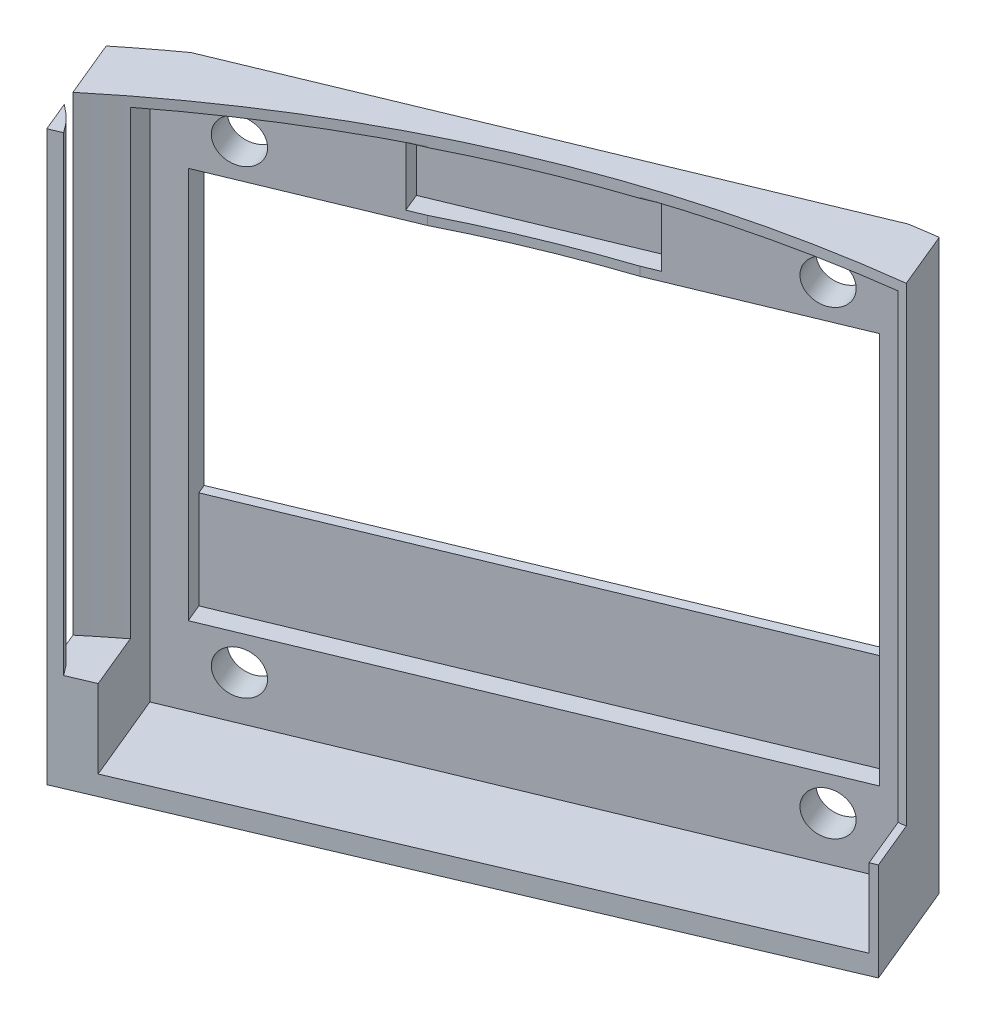
ISO-10303-21;
HEADER;
FILE_DESCRIPTION(('STEP AP214'),'2;1');
FILE_NAME('part.step','',(''),(''),'','','');
FILE_SCHEMA(('AUTOMOTIVE_DESIGN { 1 0 10303 214 1 1 1 1 }'));
ENDSEC;
DATA;
#1=APPLICATION_CONTEXT('core data for automotive mechanical design processes');
#2=APPLICATION_PROTOCOL_DEFINITION('international standard','automotive_design',2000,#1);
#3=PRODUCT_CONTEXT('',#1,'mechanical');
#4=PRODUCT('Part','Part','',(#3));
#5=PRODUCT_RELATED_PRODUCT_CATEGORY('part','',(#4));
#6=PRODUCT_DEFINITION_FORMATION('','',#4);
#7=PRODUCT_DEFINITION_CONTEXT('part definition',#1,'design');
#8=PRODUCT_DEFINITION('design','',#6,#7);
#9=PRODUCT_DEFINITION_SHAPE('','',#8);
#10=(LENGTH_UNIT() NAMED_UNIT(*) SI_UNIT(.MILLI.,.METRE.));
#11=(NAMED_UNIT(*) PLANE_ANGLE_UNIT() SI_UNIT($,.RADIAN.));
#12=(NAMED_UNIT(*) SI_UNIT($,.STERADIAN.) SOLID_ANGLE_UNIT());
#13=UNCERTAINTY_MEASURE_WITH_UNIT(LENGTH_MEASURE(1.E-05),#10,'distance_accuracy_value','');
#14=(GEOMETRIC_REPRESENTATION_CONTEXT(3) GLOBAL_UNCERTAINTY_ASSIGNED_CONTEXT((#13)) GLOBAL_UNIT_ASSIGNED_CONTEXT((#10,
#11,#12)) REPRESENTATION_CONTEXT('',''));
#15=CARTESIAN_POINT('',(0.,0.,0.));
#16=DIRECTION('',(0.,0.,1.));
#17=DIRECTION('',(1.,0.,0.));
#18=AXIS2_PLACEMENT_3D('',#15,#16,#17);
#19=CARTESIAN_POINT('',(0.,5.,0.));
#20=DIRECTION('',(0.,1.,0.));
#21=DIRECTION('',(0.,0.,1.));
#22=AXIS2_PLACEMENT_3D('',#19,#20,#21);
#23=PLANE('',#22);
#24=CARTESIAN_POINT('',(-39.2444263558534,5.,-39.2444263558534));
#25=DIRECTION('',(0.,1.,0.));
#26=DIRECTION('',(0.,0.,1.));
#27=AXIS2_PLACEMENT_3D('',#24,#25,#26);
#28=CIRCLE('',#27,5.);
#29=CARTESIAN_POINT('',(-35.1068462298313,5.,-42.0516368397229));
#30=VERTEX_POINT('',#29);
#31=CARTESIAN_POINT('',(-36.3429236669221,5.,-43.3164384071769));
#32=VERTEX_POINT('',#31);
#33=EDGE_CURVE('E429',#30,#32,#28,.T.);
#34=ORIENTED_EDGE('',*,*,#33,.F.);
#35=DIRECTION('',(0.920023978989581,0.,-0.391862065125192));
#36=VECTOR('',#35,1.);
#37=CARTESIAN_POINT('',(-20.5514236895549,5.,-48.2511686624332));
#38=LINE('',#37,#36);
#39=CARTESIAN_POINT('',(-33.8720834554536,5.00000000000001,-42.5775543176985));
#40=VERTEX_POINT('',#39);
#41=EDGE_CURVE('E248',#30,#40,#38,.T.);
#42=ORIENTED_EDGE('',*,*,#41,.T.);
#43=DIRECTION('',(-0.382683432365087,0.,-0.923879532511288));
#44=VECTOR('',#43,1.);
#45=CARTESIAN_POINT('',(-13.8581929876693,5.,5.74025148547631));
#46=LINE('',#45,#44);
#47=CARTESIAN_POINT('',(-35.0311914089504,5.,-45.3758884592851));
#48=VERTEX_POINT('',#47);
#49=EDGE_CURVE('E427',#40,#48,#46,.T.);
#50=ORIENTED_EDGE('',*,*,#49,.T.);
#51=CARTESIAN_POINT('',(0.,5.,0.));
#52=DIRECTION('',(0.,1.,0.));
#53=DIRECTION('',(0.,0.,1.));
#54=AXIS2_PLACEMENT_3D('',#51,#52,#53);
#55=CIRCLE('',#54,57.325);
#56=CARTESIAN_POINT('',(-36.6564479691503,5.,-44.07335302975));
#57=VERTEX_POINT('',#56);
#58=EDGE_CURVE('E445',#57,#48,#55,.F.);
#59=ORIENTED_EDGE('',*,*,#58,.F.);
#60=DIRECTION('',(0.382683432365087,0.,0.923879532511288));
#61=VECTOR('',#60,1.);
#62=CARTESIAN_POINT('',(-15.7059520526919,5.,6.50561835020648));
#63=LINE('',#62,#61);
#64=EDGE_CURVE('E267',#57,#32,#63,.T.);
#65=ORIENTED_EDGE('',*,*,#64,.T.);
#66=EDGE_LOOP('',(#34,#42,#50,#59,#65));
#67=FACE_BOUND('',#66,.T.);
#68=ADVANCED_FACE('F39',(#67),#23,.T.);
#69=DIRECTION('',(0.382683432365087,0.,0.923879532511288));
#70=VECTOR('',#69,1.);
#71=CARTESIAN_POINT('',(13.8581929876693,5.,-5.74025148547631));
#72=LINE('',#71,#70);
#73=CARTESIAN_POINT('',(-7.31480543361179,5.,-56.8563914302377));
#74=VERTEX_POINT('',#73);
#75=CARTESIAN_POINT('',(-6.26999622855717,5.,-54.3339988773025));
#76=VERTEX_POINT('',#75);
#77=EDGE_CURVE('E245',#74,#76,#72,.T.);
#78=ORIENTED_EDGE('',*,*,#77,.T.);
#79=CARTESIAN_POINT('',(-5.93666930916487,5.00000000000002,-54.4759714540808));
#80=VERTEX_POINT('',#79);
#81=EDGE_CURVE('E234',#76,#80,#38,.T.);
#82=ORIENTED_EDGE('',*,*,#81,.T.);
#83=DIRECTION('',(-0.382683432365087,0.,-0.923879532511288));
#84=VECTOR('',#83,1.);
#85=CARTESIAN_POINT('',(14.1929001957838,5.,-5.87889175050137));
#86=LINE('',#85,#84);
#87=CARTESIAN_POINT('',(-6.94202306052283,5.,-56.9031101155918));
#88=VERTEX_POINT('',#87);
#89=EDGE_CURVE('E243',#80,#88,#86,.T.);
#90=ORIENTED_EDGE('',*,*,#89,.T.);
#91=EDGE_CURVE('E444',#74,#88,#55,.F.);
#92=ORIENTED_EDGE('',*,*,#91,.F.);
#93=EDGE_LOOP('',(#78,#82,#90,#92));
#94=FACE_BOUND('',#93,.T.);
#95=ADVANCED_FACE('F241',(#94),#23,.T.);
#96=CARTESIAN_POINT('',(0.,0.,0.));
#97=DIRECTION('',(0.,1.,0.));
#98=DIRECTION('',(0.,0.,1.));
#99=AXIS2_PLACEMENT_3D('',#96,#97,#98);
#100=PLANE('',#99);
#101=DIRECTION('',(0.920023978989581,0.,-0.391862065125192));
#102=VECTOR('',#101,1.);
#103=CARTESIAN_POINT('',(-20.5514236895549,0.,-48.2511686624332));
#104=LINE('',#103,#102);
#105=CARTESIAN_POINT('',(-35.7122226039134,0.,-41.7937913470582));
#106=VERTEX_POINT('',#105);
#107=CARTESIAN_POINT('',(-5.93666930916487,0.,-54.4759714540808));
#108=VERTEX_POINT('',#107);
#109=EDGE_CURVE('E54',#106,#108,#104,.T.);
#110=ORIENTED_EDGE('',*,*,#109,.F.);
#111=DIRECTION('',(0.382683432365087,0.,0.923879532511288));
#112=VECTOR('',#111,1.);
#113=CARTESIAN_POINT('',(-15.7059520526919,0.,6.50561835020648));
#114=LINE('',#113,#112);
#115=CARTESIAN_POINT('',(-37.8557062259473,0.,-46.9686185780972));
#116=VERTEX_POINT('',#115);
#117=EDGE_CURVE('E274',#116,#106,#114,.T.);
#118=ORIENTED_EDGE('',*,*,#117,.F.);
#119=CARTESIAN_POINT('',(0.,0.,0.));
#120=DIRECTION('',(0.,1.,0.));
#121=DIRECTION('',(0.,0.,1.));
#122=AXIS2_PLACEMENT_3D('',#119,#120,#121);
#123=CIRCLE('',#122,60.325);
#124=CARTESIAN_POINT('',(-35.3998071923561,0.,-48.8462821076897));
#125=VERTEX_POINT('',#124);
#126=EDGE_CURVE('E441',#125,#116,#123,.T.);
#127=ORIENTED_EDGE('',*,*,#126,.F.);
#128=DIRECTION('',(0.923879532511288,0.,-0.382683432365087));
#129=VECTOR('',#128,1.);
#130=CARTESIAN_POINT('',(-22.4539503940215,0.,-54.2086315700998));
#131=LINE('',#130,#129);
#132=CARTESIAN_POINT('',(-9.50809359568686,0.,-59.5709810325099));
#133=VERTEX_POINT('',#132);
#134=EDGE_CURVE('E367',#125,#133,#131,.T.);
#135=ORIENTED_EDGE('',*,*,#134,.T.);
#136=CARTESIAN_POINT('',(-8.13137609349541,0.,-59.7744623382438));
#137=VERTEX_POINT('',#136);
#138=EDGE_CURVE('E440',#137,#133,#123,.T.);
#139=ORIENTED_EDGE('',*,*,#138,.F.);
#140=DIRECTION('',(-0.382683432365087,0.,-0.923879532511288));
#141=VECTOR('',#140,1.);
#142=CARTESIAN_POINT('',(14.1929001957838,0.,-5.87889175050137));
#143=LINE('',#142,#141);
#144=EDGE_CURVE('E260',#108,#137,#143,.T.);
#145=ORIENTED_EDGE('',*,*,#144,.F.);
#146=EDGE_LOOP('',(#110,#118,#127,#135,#139,#145));
#147=FACE_BOUND('',#146,.T.);
#148=ADVANCED_FACE('F552',(#147),#100,.F.);
#149=CARTESIAN_POINT('',(0.,29.,0.));
#150=DIRECTION('',(0.,1.,0.));
#151=DIRECTION('',(0.,0.,1.));
#152=AXIS2_PLACEMENT_3D('',#149,#150,#151);
#153=PLANE('',#152);
#154=DIRECTION('',(0.382683432365087,0.,0.923879532511288));
#155=VECTOR('',#154,1.);
#156=CARTESIAN_POINT('',(-15.7059520526919,29.,6.50561835020648));
#157=LINE('',#156,#155);
#158=CARTESIAN_POINT('',(-36.3429236669221,29.,-43.3164384071769));
#159=VERTEX_POINT('',#158);
#160=CARTESIAN_POINT('',(-35.7122226039134,29.,-41.7937913470583));
#161=VERTEX_POINT('',#160);
#162=EDGE_CURVE('E266',#159,#161,#157,.T.);
#163=ORIENTED_EDGE('',*,*,#162,.T.);
#164=DIRECTION('',(0.920023978989581,0.,-0.391862065125192));
#165=VECTOR('',#164,1.);
#166=CARTESIAN_POINT('',(-20.5514236895549,29.,-48.2511686624332));
#167=LINE('',#166,#165);
#168=CARTESIAN_POINT('',(-35.1068462298313,29.,-42.0516368397229));
#169=VERTEX_POINT('',#168);
#170=EDGE_CURVE('E525',#161,#169,#167,.T.);
#171=ORIENTED_EDGE('',*,*,#170,.T.);
#172=CARTESIAN_POINT('',(-39.2444263558534,29.,-39.2444263558534));
#173=DIRECTION('',(0.,1.,0.));
#174=DIRECTION('',(0.,0.,1.));
#175=AXIS2_PLACEMENT_3D('',#172,#173,#174);
#176=CIRCLE('',#175,5.);
#177=EDGE_CURVE('E430',#169,#159,#176,.T.);
#178=ORIENTED_EDGE('',*,*,#177,.T.);
#179=EDGE_LOOP('',(#163,#171,#178));
#180=FACE_BOUND('',#179,.T.);
#181=ADVANCED_FACE('F550',(#180),#153,.T.);
#182=CARTESIAN_POINT('',(-39.2444263558534,29.,-39.2444263558534));
#183=DIRECTION('',(0.,-1.,0.));
#184=DIRECTION('',(0.,0.,-1.));
#185=AXIS2_PLACEMENT_3D('',#182,#183,#184);
#186=CYLINDRICAL_SURFACE('',#185,5.);
#187=DIRECTION('',(0.,-1.,0.));
#188=VECTOR('',#187,1.);
#189=CARTESIAN_POINT('',(-35.1068462298313,29.,-42.0516368397229));
#190=LINE('',#189,#188);
#191=EDGE_CURVE('E253',#30,#169,#190,.F.);
#192=ORIENTED_EDGE('',*,*,#191,.F.);
#193=ORIENTED_EDGE('',*,*,#33,.T.);
#194=DIRECTION('',(0.,-1.,0.));
#195=VECTOR('',#194,1.);
#196=CARTESIAN_POINT('',(-36.3429236669221,29.,-43.3164384071769));
#197=LINE('',#196,#195);
#198=EDGE_CURVE('E279',#159,#32,#197,.T.);
#199=ORIENTED_EDGE('',*,*,#198,.F.);
#200=ORIENTED_EDGE('',*,*,#177,.F.);
#201=EDGE_LOOP('',(#192,#193,#199,#200));
#202=FACE_BOUND('',#201,.T.);
#203=ADVANCED_FACE('F548',(#202),#186,.T.);
#204=CARTESIAN_POINT('',(-33.2506759227701,28.5,-41.0773438245332));
#205=DIRECTION('',(0.923879532511288,0.,-0.382683432365087));
#206=DIRECTION('',(-0.382683432365087,0.,-0.923879532511288));
#207=AXIS2_PLACEMENT_3D('',#204,#205,#206);
#208=PLANE('',#207);
#209=ORIENTED_EDGE('',*,*,#49,.F.);
#210=DIRECTION('',(0.,-1.,0.));
#211=VECTOR('',#210,1.);
#212=CARTESIAN_POINT('',(-33.8720834554536,28.5,-42.5775543176985));
#213=LINE('',#212,#211);
#214=CARTESIAN_POINT('',(-33.8720834554536,0.999999999999997,-42.5775543176985));
#215=VERTEX_POINT('',#214);
#216=EDGE_CURVE('E519',#40,#215,#213,.T.);
#217=ORIENTED_EDGE('',*,*,#216,.T.);
#218=DIRECTION('',(-0.382683432365087,0.,-0.923879532511288));
#219=VECTOR('',#218,1.);
#220=CARTESIAN_POINT('',(-33.2506759227701,0.999999999999997,-41.0773438245332));
#221=LINE('',#220,#219);
#222=CARTESIAN_POINT('',(-35.7381182331432,0.999999999999997,-47.0825607858566));
#223=VERTEX_POINT('',#222);
#224=EDGE_CURVE('E420',#215,#223,#221,.T.);
#225=ORIENTED_EDGE('',*,*,#224,.T.);
#226=DIRECTION('',(0.,-1.,0.));
#227=VECTOR('',#226,1.);
#228=CARTESIAN_POINT('',(-35.7381182331432,28.5,-47.0825607858566));
#229=LINE('',#228,#227);
#230=CARTESIAN_POINT('',(-35.7381182331432,28.5,-47.0825607858566));
#231=VERTEX_POINT('',#230);
#232=EDGE_CURVE('E407',#231,#223,#229,.T.);
#233=ORIENTED_EDGE('',*,*,#232,.F.);
#234=DIRECTION('',(-0.382683432365087,0.,-0.923879532511288));
#235=VECTOR('',#234,1.);
#236=CARTESIAN_POINT('',(-33.2506759227701,28.5,-41.0773438245332));
#237=LINE('',#236,#235);
#238=CARTESIAN_POINT('',(-35.0311914089504,28.5,-45.3758884592851));
#239=VERTEX_POINT('',#238);
#240=EDGE_CURVE('E422',#239,#231,#237,.T.);
#241=ORIENTED_EDGE('',*,*,#240,.F.);
#242=DIRECTION('',(0.,-1.,0.));
#243=VECTOR('',#242,1.);
#244=CARTESIAN_POINT('',(-35.0311914089504,29.,-45.3758884592851));
#245=LINE('',#244,#243);
#246=EDGE_CURVE('E462',#48,#239,#245,.F.);
#247=ORIENTED_EDGE('',*,*,#246,.F.);
#248=EDGE_LOOP('',(#209,#217,#225,#233,#241,#247));
#249=FACE_BOUND('',#248,.T.);
#250=ADVANCED_FACE('F538',(#249),#208,.T.);
#251=CARTESIAN_POINT('',(-5.53428994743148,1.,-52.5578467954858));
#252=DIRECTION('',(0.,1.,0.));
#253=DIRECTION('',(-1.,0.,0.));
#254=AXIS2_PLACEMENT_3D('',#251,#252,#253);
#255=PLANE('',#254);
#256=ORIENTED_EDGE('',*,*,#224,.F.);
#257=DIRECTION('',(0.920023978989581,0.,-0.391862065125192));
#258=VECTOR('',#257,1.);
#259=CARTESIAN_POINT('',(-6.28760475391389,1.,-54.3264989498358));
#260=LINE('',#259,#258);
#261=CARTESIAN_POINT('',(-6.26999622855718,1.,-54.3339988773026));
#262=VERTEX_POINT('',#261);
#263=EDGE_CURVE('E517',#215,#262,#260,.T.);
#264=ORIENTED_EDGE('',*,*,#263,.T.);
#265=DIRECTION('',(-0.382683432365087,0.,-0.923879532511288));
#266=VECTOR('',#265,1.);
#267=CARTESIAN_POINT('',(-5.53428994743148,1.,-52.5578467954858));
#268=LINE('',#267,#266);
#269=CARTESIAN_POINT('',(-8.02173225780455,1.,-58.5630637568092));
#270=VERTEX_POINT('',#269);
#271=EDGE_CURVE('E418',#262,#270,#268,.T.);
#272=ORIENTED_EDGE('',*,*,#271,.T.);
#273=DIRECTION('',(0.923879532511288,0.,-0.382683432365087));
#274=VECTOR('',#273,1.);
#275=CARTESIAN_POINT('',(-8.02173225780455,1.,-58.5630637568092));
#276=LINE('',#275,#274);
#277=EDGE_CURVE('E410',#223,#270,#276,.T.);
#278=ORIENTED_EDGE('',*,*,#277,.F.);
#279=EDGE_LOOP('',(#256,#264,#272,#278));
#280=FACE_BOUND('',#279,.T.);
#281=ADVANCED_FACE('F638',(#280),#255,.T.);
#282=CARTESIAN_POINT('',(-5.53428994743148,28.5,-52.5578467954858));
#283=DIRECTION('',(-0.923879532511288,0.,0.382683432365087));
#284=DIRECTION('',(0.382683432365087,0.,0.923879532511288));
#285=AXIS2_PLACEMENT_3D('',#282,#283,#284);
#286=PLANE('',#285);
#287=ORIENTED_EDGE('',*,*,#271,.F.);
#288=DIRECTION('',(0.,1.,0.));
#289=VECTOR('',#288,1.);
#290=CARTESIAN_POINT('',(-6.26999622855718,28.5,-54.3339988773026));
#291=LINE('',#290,#289);
#292=EDGE_CURVE('E515',#262,#76,#291,.T.);
#293=ORIENTED_EDGE('',*,*,#292,.T.);
#294=ORIENTED_EDGE('',*,*,#77,.F.);
#295=DIRECTION('',(0.,-1.,0.));
#296=VECTOR('',#295,1.);
#297=CARTESIAN_POINT('',(-7.31480543361179,29.,-56.8563914302377));
#298=LINE('',#297,#296);
#299=CARTESIAN_POINT('',(-7.31480543361179,28.5,-56.8563914302377));
#300=VERTEX_POINT('',#299);
#301=EDGE_CURVE('E454',#300,#74,#298,.T.);
#302=ORIENTED_EDGE('',*,*,#301,.F.);
#303=DIRECTION('',(-0.382683432365087,0.,-0.923879532511288));
#304=VECTOR('',#303,1.);
#305=CARTESIAN_POINT('',(-5.53428994743148,28.5,-52.5578467954858));
#306=LINE('',#305,#304);
#307=CARTESIAN_POINT('',(-8.02173225780455,28.5,-58.5630637568092));
#308=VERTEX_POINT('',#307);
#309=EDGE_CURVE('E416',#300,#308,#306,.T.);
#310=ORIENTED_EDGE('',*,*,#309,.T.);
#311=DIRECTION('',(0.,1.,0.));
#312=VECTOR('',#311,1.);
#313=CARTESIAN_POINT('',(-8.02173225780455,28.5,-58.5630637568092));
#314=LINE('',#313,#312);
#315=EDGE_CURVE('E413',#270,#308,#314,.T.);
#316=ORIENTED_EDGE('',*,*,#315,.F.);
#317=EDGE_LOOP('',(#287,#293,#294,#302,#310,#316));
#318=FACE_BOUND('',#317,.T.);
#319=ADVANCED_FACE('F514',(#318),#286,.T.);
#320=CARTESIAN_POINT('',(8.52747630182726,45.0003405831403,65.0102897464838));
#321=DIRECTION('',(-0.923879532511288,0.,0.382683432365087));
#322=DIRECTION('',(0.382683432365087,0.,0.923879532511288));
#323=AXIS2_PLACEMENT_3D('',#320,#321,#322);
#324=PLANE('',#323);
#325=ORIENTED_EDGE('',*,*,#117,.T.);
#326=DIRECTION('',(0.,1.,0.));
#327=VECTOR('',#326,1.);
#328=CARTESIAN_POINT('',(-35.7122226039134,45.0003405831403,-41.7937913470583));
#329=LINE('',#328,#327);
#330=EDGE_CURVE('E246',#106,#161,#329,.T.);
#331=ORIENTED_EDGE('',*,*,#330,.T.);
#332=ORIENTED_EDGE('',*,*,#162,.F.);
#333=ORIENTED_EDGE('',*,*,#198,.T.);
#334=ORIENTED_EDGE('',*,*,#64,.F.);
#335=DIRECTION('',(0.,-1.,0.));
#336=VECTOR('',#335,1.);
#337=CARTESIAN_POINT('',(-36.6564479691503,29.,-44.07335302975));
#338=LINE('',#337,#336);
#339=CARTESIAN_POINT('',(-36.6564479691503,29.,-44.07335302975));
#340=VERTEX_POINT('',#339);
#341=EDGE_CURVE('E270',#340,#57,#338,.T.);
#342=ORIENTED_EDGE('',*,*,#341,.F.);
#343=CARTESIAN_POINT('',(-37.8557062259473,29.,-46.9686185780972));
#344=VERTEX_POINT('',#343);
#345=EDGE_CURVE('E271',#344,#340,#157,.T.);
#346=ORIENTED_EDGE('',*,*,#345,.F.);
#347=DIRECTION('',(0.,-1.,0.));
#348=VECTOR('',#347,1.);
#349=CARTESIAN_POINT('',(-37.8557062259473,5.,-46.9686185780972));
#350=LINE('',#349,#348);
#351=EDGE_CURVE('E277',#344,#116,#350,.T.);
#352=ORIENTED_EDGE('',*,*,#351,.T.);
#353=EDGE_LOOP('',(#325,#331,#332,#333,#334,#342,#346,#352));
#354=FACE_BOUND('',#353,.T.);
#355=ADVANCED_FACE('F543',(#354),#324,.T.);
#356=CARTESIAN_POINT('',(38.426328550303,45.0003405831403,52.6257796457759));
#357=DIRECTION('',(0.923879532511288,0.,-0.382683432365087));
#358=DIRECTION('',(-0.382683432365087,0.,-0.923879532511288));
#359=AXIS2_PLACEMENT_3D('',#356,#357,#358);
#360=PLANE('',#359);
#361=ORIENTED_EDGE('',*,*,#89,.F.);
#362=DIRECTION('',(0.,-1.,0.));
#363=VECTOR('',#362,1.);
#364=CARTESIAN_POINT('',(-5.93666930916487,45.0003405831403,-54.4759714540808));
#365=LINE('',#364,#363);
#366=EDGE_CURVE('E11',#80,#108,#365,.T.);
#367=ORIENTED_EDGE('',*,*,#366,.T.);
#368=ORIENTED_EDGE('',*,*,#144,.T.);
#369=DIRECTION('',(0.,-1.,0.));
#370=VECTOR('',#369,1.);
#371=CARTESIAN_POINT('',(-8.13137609349541,5.,-59.7744623382438));
#372=LINE('',#371,#370);
#373=CARTESIAN_POINT('',(-8.13137609349541,29.,-59.7744623382438));
#374=VERTEX_POINT('',#373);
#375=EDGE_CURVE('E262',#137,#374,#372,.F.);
#376=ORIENTED_EDGE('',*,*,#375,.T.);
#377=DIRECTION('',(-0.382683432365087,0.,-0.923879532511288));
#378=VECTOR('',#377,1.);
#379=CARTESIAN_POINT('',(14.1929001957838,29.,-5.87889175050137));
#380=LINE('',#379,#378);
#381=CARTESIAN_POINT('',(-6.94202306052283,29.,-56.9031101155918));
#382=VERTEX_POINT('',#381);
#383=EDGE_CURVE('E255',#382,#374,#380,.T.);
#384=ORIENTED_EDGE('',*,*,#383,.F.);
#385=DIRECTION('',(0.,-1.,0.));
#386=VECTOR('',#385,1.);
#387=CARTESIAN_POINT('',(-6.94202306052283,29.,-56.9031101155918));
#388=LINE('',#387,#386);
#389=EDGE_CURVE('E251',#88,#382,#388,.F.);
#390=ORIENTED_EDGE('',*,*,#389,.F.);
#391=EDGE_LOOP('',(#361,#367,#368,#376,#384,#390));
#392=FACE_BOUND('',#391,.T.);
#393=ADVANCED_FACE('F249',(#392),#360,.T.);
#394=CARTESIAN_POINT('',(0.,29.,0.));
#395=DIRECTION('',(0.,-1.,0.));
#396=DIRECTION('',(0.,0.,-1.));
#397=AXIS2_PLACEMENT_3D('',#394,#395,#396);
#398=CYLINDRICAL_SURFACE('',#397,57.325);
#399=CARTESIAN_POINT('',(0.,29.,0.));
#400=DIRECTION('',(0.,1.,0.));
#401=DIRECTION('',(0.,0.,1.));
#402=AXIS2_PLACEMENT_3D('',#399,#400,#401);
#403=CIRCLE('',#402,57.325);
#404=EDGE_CURVE('E432',#382,#340,#403,.T.);
#405=ORIENTED_EDGE('',*,*,#404,.T.);
#406=ORIENTED_EDGE('',*,*,#341,.T.);
#407=ORIENTED_EDGE('',*,*,#58,.T.);
#408=ORIENTED_EDGE('',*,*,#246,.T.);
#409=CARTESIAN_POINT('',(0.,28.5,0.));
#410=DIRECTION('',(0.,-1.,0.));
#411=DIRECTION('',(1.,0.,0.));
#412=AXIS2_PLACEMENT_3D('',#409,#410,#411);
#413=CIRCLE('',#412,57.325);
#414=CARTESIAN_POINT('',(-25.7087343923811,28.5,-51.2368675949457));
#415=VERTEX_POINT('',#414);
#416=EDGE_CURVE('E455',#239,#415,#413,.T.);
#417=ORIENTED_EDGE('',*,*,#416,.T.);
#418=DIRECTION('',(0.,-1.,0.));
#419=VECTOR('',#418,1.);
#420=CARTESIAN_POINT('',(-25.7087343923811,29.,-51.2368675949457));
#421=LINE('',#420,#419);
#422=CARTESIAN_POINT('',(-25.7087343923811,28.4500047843018,-51.2368675949457));
#423=VERTEX_POINT('',#422);
#424=EDGE_CURVE('E459',#415,#423,#421,.T.);
#425=ORIENTED_EDGE('',*,*,#424,.T.);
#426=CARTESIAN_POINT('',(0.,28.4500047843018,0.));
#427=DIRECTION('',(0.,1.,0.));
#428=DIRECTION('',(0.,0.,1.));
#429=AXIS2_PLACEMENT_3D('',#426,#427,#428);
#430=CIRCLE('',#429,57.325);
#431=CARTESIAN_POINT('',(-18.0511160985666,28.4500047843018,-54.40875694772));
#432=VERTEX_POINT('',#431);
#433=EDGE_CURVE('E334',#432,#423,#430,.T.);
#434=ORIENTED_EDGE('',*,*,#433,.F.);
#435=DIRECTION('',(0.,-1.,0.));
#436=VECTOR('',#435,1.);
#437=CARTESIAN_POINT('',(-18.0511160985666,29.,-54.40875694772));
#438=LINE('',#437,#436);
#439=CARTESIAN_POINT('',(-18.0511160985666,28.5,-54.40875694772));
#440=VERTEX_POINT('',#439);
#441=EDGE_CURVE('E448',#432,#440,#438,.F.);
#442=ORIENTED_EDGE('',*,*,#441,.T.);
#443=EDGE_CURVE('E451',#440,#300,#413,.T.);
#444=ORIENTED_EDGE('',*,*,#443,.T.);
#445=ORIENTED_EDGE('',*,*,#301,.T.);
#446=ORIENTED_EDGE('',*,*,#91,.T.);
#447=ORIENTED_EDGE('',*,*,#389,.T.);
#448=EDGE_LOOP('',(#405,#406,#407,#408,#417,#425,#434,#442,#444,#445,#446,#447));
#449=FACE_BOUND('',#448,.T.);
#450=ADVANCED_FACE('F504',(#449),#398,.F.);
#451=CARTESIAN_POINT('',(0.,5.,0.));
#452=DIRECTION('',(0.,-1.,0.));
#453=DIRECTION('',(0.,0.,-1.));
#454=AXIS2_PLACEMENT_3D('',#451,#452,#453);
#455=CYLINDRICAL_SURFACE('',#454,60.325);
#456=ORIENTED_EDGE('',*,*,#351,.F.);
#457=CARTESIAN_POINT('',(0.,29.,0.));
#458=DIRECTION('',(0.,1.,0.));
#459=DIRECTION('',(0.,0.,1.));
#460=AXIS2_PLACEMENT_3D('',#457,#458,#459);
#461=CIRCLE('',#460,60.325);
#462=CARTESIAN_POINT('',(-35.3998071923561,29.,-48.8462821076897));
#463=VERTEX_POINT('',#462);
#464=EDGE_CURVE('E437',#463,#344,#461,.T.);
#465=ORIENTED_EDGE('',*,*,#464,.F.);
#466=DIRECTION('',(0.,-1.,0.));
#467=VECTOR('',#466,1.);
#468=CARTESIAN_POINT('',(-35.3998071923561,5.,-48.8462821076897));
#469=LINE('',#468,#467);
#470=EDGE_CURVE('E364',#463,#125,#469,.T.);
#471=ORIENTED_EDGE('',*,*,#470,.T.);
#472=ORIENTED_EDGE('',*,*,#126,.T.);
#473=EDGE_LOOP('',(#456,#465,#471,#472));
#474=FACE_BOUND('',#473,.T.);
#475=ADVANCED_FACE('F41',(#474),#455,.T.);
#476=ORIENTED_EDGE('',*,*,#375,.F.);
#477=ORIENTED_EDGE('',*,*,#138,.T.);
#478=DIRECTION('',(0.,-1.,0.));
#479=VECTOR('',#478,1.);
#480=CARTESIAN_POINT('',(-9.50809359568686,5.,-59.5709810325099));
#481=LINE('',#480,#479);
#482=CARTESIAN_POINT('',(-9.50809359568686,29.,-59.5709810325099));
#483=VERTEX_POINT('',#482);
#484=EDGE_CURVE('E361',#133,#483,#481,.F.);
#485=ORIENTED_EDGE('',*,*,#484,.T.);
#486=EDGE_CURVE('E436',#374,#483,#461,.T.);
#487=ORIENTED_EDGE('',*,*,#486,.F.);
#488=EDGE_LOOP('',(#476,#477,#485,#487));
#489=FACE_BOUND('',#488,.T.);
#490=ADVANCED_FACE('F565',(#489),#455,.T.);
#491=ORIENTED_EDGE('',*,*,#464,.T.);
#492=ORIENTED_EDGE('',*,*,#345,.T.);
#493=ORIENTED_EDGE('',*,*,#404,.F.);
#494=ORIENTED_EDGE('',*,*,#383,.T.);
#495=ORIENTED_EDGE('',*,*,#486,.T.);
#496=DIRECTION('',(0.923879532511288,0.,-0.382683432365087));
#497=VECTOR('',#496,1.);
#498=CARTESIAN_POINT('',(-22.4539503940215,29.,-54.2086315700998));
#499=LINE('',#498,#497);
#500=EDGE_CURVE('E358',#463,#483,#499,.T.);
#501=ORIENTED_EDGE('',*,*,#500,.F.);
#502=EDGE_LOOP('',(#491,#492,#493,#494,#495,#501));
#503=FACE_BOUND('',#502,.T.);
#504=ADVANCED_FACE('F554',(#503),#153,.T.);
#505=CARTESIAN_POINT('',(-36.2657160962017,10.,-52.2759835969606));
#506=DIRECTION('',(0.,-1.,0.));
#507=DIRECTION('',(0.,0.,-1.));
#508=AXIS2_PLACEMENT_3D('',#505,#506,#507);
#509=PLANE('',#508);
#510=DIRECTION('',(-0.923879532511288,0.,0.382683432365087));
#511=VECTOR('',#510,1.);
#512=CARTESIAN_POINT('',(-34.7349823667413,10.,-48.5804654669155));
#513=LINE('',#512,#511);
#514=CARTESIAN_POINT('',(-9.79023498893658,10.,-58.9129181407728));
#515=VERTEX_POINT('',#514);
#516=CARTESIAN_POINT('',(-34.7349823667413,10.,-48.5804654669155));
#517=VERTEX_POINT('',#516);
#518=EDGE_CURVE('E321',#515,#517,#513,.T.);
#519=ORIENTED_EDGE('',*,*,#518,.F.);
#520=DIRECTION('',(0.382683432365088,0.,0.923879532511288));
#521=VECTOR('',#520,1.);
#522=CARTESIAN_POINT('',(-11.3209687183969,10.,-62.608436270818));
#523=LINE('',#522,#521);
#524=CARTESIAN_POINT('',(-9.98157670511913,10.,-59.3748579070285));
#525=VERTEX_POINT('',#524);
#526=EDGE_CURVE('E396',#525,#515,#523,.T.);
#527=ORIENTED_EDGE('',*,*,#526,.F.);
#528=DIRECTION('',(-0.923879532511288,0.,0.382683432365087));
#529=VECTOR('',#528,1.);
#530=CARTESIAN_POINT('',(-34.9263240829239,10.,-49.0424052331711));
#531=LINE('',#530,#529);
#532=CARTESIAN_POINT('',(-34.9263240829239,10.,-49.0424052331711));
#533=VERTEX_POINT('',#532);
#534=EDGE_CURVE('E346',#525,#533,#531,.T.);
#535=ORIENTED_EDGE('',*,*,#534,.T.);
#536=DIRECTION('',(0.382683432365088,0.,0.923879532511288));
#537=VECTOR('',#536,1.);
#538=CARTESIAN_POINT('',(-36.2657160962017,10.,-52.2759835969606));
#539=LINE('',#538,#537);
#540=EDGE_CURVE('E390',#533,#517,#539,.T.);
#541=ORIENTED_EDGE('',*,*,#540,.T.);
#542=EDGE_LOOP('',(#519,#527,#535,#541));
#543=FACE_BOUND('',#542,.T.);
#544=ADVANCED_FACE('F564',(#543),#509,.F.);
#545=CARTESIAN_POINT('',(0.,25.4500047843018,0.));
#546=DIRECTION('',(0.,-1.,0.));
#547=DIRECTION('',(0.,0.,-1.));
#548=AXIS2_PLACEMENT_3D('',#545,#546,#547);
#549=CIRCLE('',#548,57.325);
#550=CARTESIAN_POINT('',(-25.7087343923811,25.4500047843018,-51.2368675949457));
#551=VERTEX_POINT('',#550);
#552=CARTESIAN_POINT('',(-18.0511160985666,25.4500047843018,-54.40875694772));
#553=VERTEX_POINT('',#552);
#554=EDGE_CURVE('E61',#551,#553,#549,.T.);
#555=ORIENTED_EDGE('',*,*,#554,.F.);
#556=CARTESIAN_POINT('',(-25.7087343923811,25.,-51.2368675949458));
#557=VERTEX_POINT('',#556);
#558=EDGE_CURVE('E458',#551,#557,#421,.T.);
#559=ORIENTED_EDGE('',*,*,#558,.T.);
#560=CARTESIAN_POINT('',(0.,25.,0.));
#561=DIRECTION('',(0.,1.,0.));
#562=DIRECTION('',(0.,0.,1.));
#563=AXIS2_PLACEMENT_3D('',#560,#561,#562);
#564=CIRCLE('',#563,57.325);
#565=CARTESIAN_POINT('',(-18.0511160985666,25.,-54.40875694772));
#566=VERTEX_POINT('',#565);
#567=EDGE_CURVE('E393',#566,#557,#564,.T.);
#568=ORIENTED_EDGE('',*,*,#567,.F.);
#569=EDGE_CURVE('E450',#566,#553,#438,.F.);
#570=ORIENTED_EDGE('',*,*,#569,.T.);
#571=EDGE_LOOP('',(#555,#559,#568,#570));
#572=FACE_BOUND('',#571,.T.);
#573=ADVANCED_FACE('F490',(#572),#398,.F.);
#574=DIRECTION('',(0.923879532511288,0.,-0.382683432365087));
#575=VECTOR('',#574,1.);
#576=CARTESIAN_POINT('',(-21.8799252454738,5.,-52.8228122713329));
#577=LINE('',#576,#575);
#578=CARTESIAN_POINT('',(-34.3522989343762,5.,-47.6565859344042));
#579=VERTEX_POINT('',#578);
#580=CARTESIAN_POINT('',(-9.40755155657147,5.,-57.9890386082616));
#581=VERTEX_POINT('',#580);
#582=EDGE_CURVE('E424',#579,#581,#577,.T.);
#583=ORIENTED_EDGE('',*,*,#582,.T.);
#584=DIRECTION('',(0.382683432365087,0.,0.923879532511288));
#585=VECTOR('',#584,1.);
#586=CARTESIAN_POINT('',(-9.79023498893655,5.,-58.9129181407728));
#587=LINE('',#586,#585);
#588=CARTESIAN_POINT('',(-9.79023498893655,5.,-58.9129181407728));
#589=VERTEX_POINT('',#588);
#590=EDGE_CURVE('E284',#589,#581,#587,.T.);
#591=ORIENTED_EDGE('',*,*,#590,.F.);
#592=DIRECTION('',(0.923879532511288,0.,-0.382683432365087));
#593=VECTOR('',#592,1.);
#594=CARTESIAN_POINT('',(-34.7349823667413,5.,-48.5804654669155));
#595=LINE('',#594,#593);
#596=CARTESIAN_POINT('',(-34.7349823667413,5.,-48.5804654669155));
#597=VERTEX_POINT('',#596);
#598=EDGE_CURVE('E328',#597,#589,#595,.T.);
#599=ORIENTED_EDGE('',*,*,#598,.F.);
#600=DIRECTION('',(0.382683432365087,0.,0.923879532511288));
#601=VECTOR('',#600,1.);
#602=CARTESIAN_POINT('',(-34.7349823667413,5.,-48.5804654669155));
#603=LINE('',#602,#601);
#604=EDGE_CURVE('E318',#597,#579,#603,.T.);
#605=ORIENTED_EDGE('',*,*,#604,.T.);
#606=EDGE_LOOP('',(#583,#591,#599,#605));
#607=FACE_BOUND('',#606,.T.);
#608=ADVANCED_FACE('F568',(#607),#23,.T.);
#609=CARTESIAN_POINT('',(-5.53428994743148,28.5,-52.5578467954858));
#610=DIRECTION('',(0.,-1.,0.));
#611=DIRECTION('',(1.,0.,0.));
#612=AXIS2_PLACEMENT_3D('',#609,#610,#611);
#613=PLANE('',#612);
#614=ORIENTED_EDGE('',*,*,#240,.T.);
#615=DIRECTION('',(-0.923879532511288,0.,0.382683432365087));
#616=VECTOR('',#615,1.);
#617=CARTESIAN_POINT('',(-8.02173225780455,28.5,-58.5630637568092));
#618=LINE('',#617,#616);
#619=EDGE_CURVE('E403',#415,#231,#618,.T.);
#620=ORIENTED_EDGE('',*,*,#619,.F.);
#621=ORIENTED_EDGE('',*,*,#416,.F.);
#622=EDGE_LOOP('',(#614,#620,#621));
#623=FACE_BOUND('',#622,.T.);
#624=ADVANCED_FACE('F573',(#623),#613,.T.);
#625=EDGE_CURVE('E404',#308,#440,#618,.T.);
#626=ORIENTED_EDGE('',*,*,#625,.F.);
#627=ORIENTED_EDGE('',*,*,#309,.F.);
#628=ORIENTED_EDGE('',*,*,#443,.F.);
#629=EDGE_LOOP('',(#626,#627,#628));
#630=FACE_BOUND('',#629,.T.);
#631=ADVANCED_FACE('F511',(#630),#613,.T.);
#632=CARTESIAN_POINT('',(-21.8799252454739,0.,-52.8228122713329));
#633=DIRECTION('',(0.382683432365087,0.,0.923879532511288));
#634=DIRECTION('',(0.923879532511288,0.,-0.382683432365087));
#635=AXIS2_PLACEMENT_3D('',#632,#633,#634);
#636=PLANE('',#635);
#637=DIRECTION('',(-0.923879532511288,0.,0.382683432365087));
#638=VECTOR('',#637,1.);
#639=CARTESIAN_POINT('',(-21.8799252454739,28.4500047843018,-52.8228122713329));
#640=LINE('',#639,#638);
#641=CARTESIAN_POINT('',(-26.4993229080303,28.4500047843018,-50.9093951095074));
#642=VERTEX_POINT('',#641);
#643=EDGE_CURVE('E47',#423,#642,#640,.T.);
#644=ORIENTED_EDGE('',*,*,#643,.F.);
#645=ORIENTED_EDGE('',*,*,#424,.F.);
#646=ORIENTED_EDGE('',*,*,#619,.T.);
#647=ORIENTED_EDGE('',*,*,#232,.T.);
#648=ORIENTED_EDGE('',*,*,#277,.T.);
#649=ORIENTED_EDGE('',*,*,#315,.T.);
#650=ORIENTED_EDGE('',*,*,#625,.T.);
#651=ORIENTED_EDGE('',*,*,#441,.F.);
#652=DIRECTION('',(-0.923879532511288,0.,0.382683432365087));
#653=VECTOR('',#652,1.);
#654=CARTESIAN_POINT('',(-26.4993229080303,28.4500047843018,-50.9093951095074));
#655=LINE('',#654,#653);
#656=CARTESIAN_POINT('',(-17.2605275829174,28.4500047843018,-54.7362294331583));
#657=VERTEX_POINT('',#656);
#658=EDGE_CURVE('E289',#657,#432,#655,.T.);
#659=ORIENTED_EDGE('',*,*,#658,.F.);
#660=DIRECTION('',(0.,1.,0.));
#661=VECTOR('',#660,1.);
#662=CARTESIAN_POINT('',(-17.2605275829174,28.4500047843018,-54.7362294331583));
#663=LINE('',#662,#661);
#664=CARTESIAN_POINT('',(-17.2605275829174,25.4500047843018,-54.7362294331583));
#665=VERTEX_POINT('',#664);
#666=EDGE_CURVE('E305',#665,#657,#663,.T.);
#667=ORIENTED_EDGE('',*,*,#666,.F.);
#668=DIRECTION('',(0.923879532511288,0.,-0.382683432365087));
#669=VECTOR('',#668,1.);
#670=CARTESIAN_POINT('',(-21.8799252454739,25.4500047843018,-52.8228122713329));
#671=LINE('',#670,#669);
#672=EDGE_CURVE('E468',#553,#665,#671,.T.);
#673=ORIENTED_EDGE('',*,*,#672,.F.);
#674=ORIENTED_EDGE('',*,*,#569,.F.);
#675=DIRECTION('',(-0.923879532511288,0.,0.382683432365088));
#676=VECTOR('',#675,1.);
#677=CARTESIAN_POINT('',(-34.3522989343763,25.,-47.6565859344042));
#678=LINE('',#677,#676);
#679=CARTESIAN_POINT('',(-9.4075515565715,25.,-57.9890386082616));
#680=VERTEX_POINT('',#679);
#681=EDGE_CURVE('E388',#680,#566,#678,.T.);
#682=ORIENTED_EDGE('',*,*,#681,.F.);
#683=DIRECTION('',(0.,1.,0.));
#684=VECTOR('',#683,1.);
#685=CARTESIAN_POINT('',(-9.4075515565715,25.,-57.9890386082616));
#686=LINE('',#685,#684);
#687=EDGE_CURVE('E385',#581,#680,#686,.T.);
#688=ORIENTED_EDGE('',*,*,#687,.F.);
#689=ORIENTED_EDGE('',*,*,#582,.F.);
#690=DIRECTION('',(0.,-1.,0.));
#691=VECTOR('',#690,1.);
#692=CARTESIAN_POINT('',(-34.3522989343763,25.,-47.6565859344042));
#693=LINE('',#692,#691);
#694=CARTESIAN_POINT('',(-34.3522989343763,25.,-47.6565859344042));
#695=VERTEX_POINT('',#694);
#696=EDGE_CURVE('E382',#695,#579,#693,.T.);
#697=ORIENTED_EDGE('',*,*,#696,.F.);
#698=DIRECTION('',(-0.923879532511288,0.,0.382683432365087));
#699=VECTOR('',#698,1.);
#700=CARTESIAN_POINT('',(-21.8799252454739,25.,-52.8228122713329));
#701=LINE('',#700,#699);
#702=EDGE_CURVE('E465',#557,#695,#701,.T.);
#703=ORIENTED_EDGE('',*,*,#702,.F.);
#704=ORIENTED_EDGE('',*,*,#558,.F.);
#705=DIRECTION('',(0.923879532511288,0.,-0.382683432365087));
#706=VECTOR('',#705,1.);
#707=CARTESIAN_POINT('',(-26.4993229080303,25.4500047843018,-50.9093951095074));
#708=LINE('',#707,#706);
#709=CARTESIAN_POINT('',(-26.4993229080303,25.4500047843018,-50.9093951095074));
#710=VERTEX_POINT('',#709);
#711=EDGE_CURVE('E302',#710,#551,#708,.T.);
#712=ORIENTED_EDGE('',*,*,#711,.F.);
#713=DIRECTION('',(0.,-1.,0.));
#714=VECTOR('',#713,1.);
#715=CARTESIAN_POINT('',(-26.4993229080303,28.4500047843018,-50.9093951095074));
#716=LINE('',#715,#714);
#717=EDGE_CURVE('E299',#642,#710,#716,.T.);
#718=ORIENTED_EDGE('',*,*,#717,.F.);
#719=EDGE_LOOP('',(#644,#645,#646,#647,#648,#649,#650,#651,#659,#667,#673,#674,#682,#688,#689,
#697,#703,#704,#712,#718));
#720=FACE_BOUND('',#719,.T.);
#721=CARTESIAN_POINT('',(-11.255310621594,3.25,-57.2236717435314));
#722=DIRECTION('',(0.382683432365088,0.,0.923879532511288));
#723=DIRECTION('',(0.923879532511288,0.,-0.382683432365088));
#724=AXIS2_PLACEMENT_3D('',#721,#722,#723);
#725=CIRCLE('',#724,1.1);
#726=CARTESIAN_POINT('',(-10.2390431358316,3.25,-57.644623519133));
#727=VERTEX_POINT('',#726);
#728=EDGE_CURVE('E370',#727,#727,#725,.T.);
#729=ORIENTED_EDGE('',*,*,#728,.F.);
#730=EDGE_LOOP('',(#729));
#731=FACE_BOUND('',#730,.T.);
#732=CARTESIAN_POINT('',(-32.5045398693537,3.25,-48.4219527991344));
#733=DIRECTION('',(0.382683432365088,0.,0.923879532511288));
#734=DIRECTION('',(0.923879532511288,0.,-0.382683432365088));
#735=AXIS2_PLACEMENT_3D('',#732,#733,#734);
#736=CIRCLE('',#735,1.1);
#737=CARTESIAN_POINT('',(-31.4882723835912,3.25,-48.842904574736));
#738=VERTEX_POINT('',#737);
#739=EDGE_CURVE('E375',#738,#738,#736,.T.);
#740=ORIENTED_EDGE('',*,*,#739,.F.);
#741=EDGE_LOOP('',(#740));
#742=FACE_BOUND('',#741,.T.);
#743=CARTESIAN_POINT('',(-32.5045398693537,26.75,-48.4219527991344));
#744=DIRECTION('',(0.382683432365088,0.,0.923879532511288));
#745=DIRECTION('',(0.923879532511288,0.,-0.382683432365088));
#746=AXIS2_PLACEMENT_3D('',#743,#744,#745);
#747=CIRCLE('',#746,1.1);
#748=CARTESIAN_POINT('',(-31.4882723835912,26.75,-48.842904574736));
#749=VERTEX_POINT('',#748);
#750=EDGE_CURVE('E371',#749,#749,#747,.T.);
#751=ORIENTED_EDGE('',*,*,#750,.F.);
#752=EDGE_LOOP('',(#751));
#753=FACE_BOUND('',#752,.T.);
#754=CARTESIAN_POINT('',(-11.255310621594,26.75,-57.2236717435314));
#755=DIRECTION('',(0.382683432365088,0.,0.923879532511288));
#756=DIRECTION('',(0.923879532511288,0.,-0.382683432365088));
#757=AXIS2_PLACEMENT_3D('',#754,#755,#756);
#758=CIRCLE('',#757,1.1);
#759=CARTESIAN_POINT('',(-10.2390431358316,26.75,-57.644623519133));
#760=VERTEX_POINT('',#759);
#761=EDGE_CURVE('E374',#760,#760,#758,.T.);
#762=ORIENTED_EDGE('',*,*,#761,.F.);
#763=EDGE_LOOP('',(#762));
#764=FACE_BOUND('',#763,.T.);
#765=ADVANCED_FACE('F482',(#720,#731,#742,#753,#764),#636,.T.);
#766=CARTESIAN_POINT('',(-36.2657160962017,25.,-52.2759835969606));
#767=DIRECTION('',(-0.923879532511288,0.,0.382683432365088));
#768=DIRECTION('',(0.382683432365088,0.,0.923879532511288));
#769=AXIS2_PLACEMENT_3D('',#766,#767,#768);
#770=PLANE('',#769);
#771=ORIENTED_EDGE('',*,*,#540,.F.);
#772=DIRECTION('',(0.,1.,0.));
#773=VECTOR('',#772,1.);
#774=CARTESIAN_POINT('',(-34.9263240829239,25.,-49.0424052331711));
#775=LINE('',#774,#773);
#776=CARTESIAN_POINT('',(-34.9263240829239,25.,-49.0424052331711));
#777=VERTEX_POINT('',#776);
#778=EDGE_CURVE('E355',#533,#777,#775,.T.);
#779=ORIENTED_EDGE('',*,*,#778,.T.);
#780=DIRECTION('',(0.382683432365088,0.,0.923879532511288));
#781=VECTOR('',#780,1.);
#782=CARTESIAN_POINT('',(-36.2657160962017,25.,-52.2759835969606));
#783=LINE('',#782,#781);
#784=EDGE_CURVE('E391',#777,#695,#783,.T.);
#785=ORIENTED_EDGE('',*,*,#784,.T.);
#786=ORIENTED_EDGE('',*,*,#696,.T.);
#787=ORIENTED_EDGE('',*,*,#604,.F.);
#788=DIRECTION('',(0.,-1.,0.));
#789=VECTOR('',#788,1.);
#790=CARTESIAN_POINT('',(-34.7349823667413,10.,-48.5804654669155));
#791=LINE('',#790,#789);
#792=EDGE_CURVE('E303',#517,#597,#791,.T.);
#793=ORIENTED_EDGE('',*,*,#792,.F.);
#794=EDGE_LOOP('',(#771,#779,#785,#786,#787,#793));
#795=FACE_BOUND('',#794,.T.);
#796=ADVANCED_FACE('F593',(#795),#770,.F.);
#797=CARTESIAN_POINT('',(-36.2657160962017,25.,-52.2759835969606));
#798=DIRECTION('',(0.,1.,0.));
#799=DIRECTION('',(0.,0.,1.));
#800=AXIS2_PLACEMENT_3D('',#797,#798,#799);
#801=PLANE('',#800);
#802=ORIENTED_EDGE('',*,*,#784,.F.);
#803=DIRECTION('',(0.923879532511288,0.,-0.382683432365087));
#804=VECTOR('',#803,1.);
#805=CARTESIAN_POINT('',(-34.9263240829239,25.,-49.0424052331711));
#806=LINE('',#805,#804);
#807=CARTESIAN_POINT('',(-9.98157670511913,25.,-59.3748579070285));
#808=VERTEX_POINT('',#807);
#809=EDGE_CURVE('E352',#777,#808,#806,.T.);
#810=ORIENTED_EDGE('',*,*,#809,.T.);
#811=DIRECTION('',(0.382683432365088,0.,0.923879532511288));
#812=VECTOR('',#811,1.);
#813=CARTESIAN_POINT('',(-11.3209687183969,25.,-62.608436270818));
#814=LINE('',#813,#812);
#815=EDGE_CURVE('E394',#808,#680,#814,.T.);
#816=ORIENTED_EDGE('',*,*,#815,.T.);
#817=ORIENTED_EDGE('',*,*,#681,.T.);
#818=ORIENTED_EDGE('',*,*,#567,.T.);
#819=ORIENTED_EDGE('',*,*,#702,.T.);
#820=EDGE_LOOP('',(#802,#810,#816,#817,#818,#819));
#821=FACE_BOUND('',#820,.T.);
#822=ADVANCED_FACE('F596',(#821),#801,.F.);
#823=CARTESIAN_POINT('',(-11.3209687183969,25.,-62.608436270818));
#824=DIRECTION('',(0.923879532511288,0.,-0.382683432365088));
#825=DIRECTION('',(-0.382683432365088,0.,-0.923879532511288));
#826=AXIS2_PLACEMENT_3D('',#823,#824,#825);
#827=PLANE('',#826);
#828=ORIENTED_EDGE('',*,*,#815,.F.);
#829=DIRECTION('',(0.,-1.,0.));
#830=VECTOR('',#829,1.);
#831=CARTESIAN_POINT('',(-9.98157670511913,25.,-59.3748579070285));
#832=LINE('',#831,#830);
#833=EDGE_CURVE('E349',#808,#525,#832,.T.);
#834=ORIENTED_EDGE('',*,*,#833,.T.);
#835=ORIENTED_EDGE('',*,*,#526,.T.);
#836=DIRECTION('',(0.,1.,0.));
#837=VECTOR('',#836,1.);
#838=CARTESIAN_POINT('',(-9.79023498893655,10.,-58.9129181407728));
#839=LINE('',#838,#837);
#840=EDGE_CURVE('E326',#589,#515,#839,.T.);
#841=ORIENTED_EDGE('',*,*,#840,.F.);
#842=ORIENTED_EDGE('',*,*,#590,.T.);
#843=ORIENTED_EDGE('',*,*,#687,.T.);
#844=EDGE_LOOP('',(#828,#834,#835,#841,#842,#843));
#845=FACE_BOUND('',#844,.T.);
#846=ADVANCED_FACE('F586',(#845),#827,.F.);
#847=CARTESIAN_POINT('',(-12.4033609186893,26.75,-59.9953103410653));
#848=DIRECTION('',(0.382683432365088,0.,0.923879532511288));
#849=DIRECTION('',(0.923879532511288,0.,-0.382683432365088));
#850=AXIS2_PLACEMENT_3D('',#847,#848,#849);
#851=CYLINDRICAL_SURFACE('',#850,1.1);
#852=CARTESIAN_POINT('',(-11.8293357701417,26.75,-58.6094910422983));
#853=DIRECTION('',(0.382683432365087,0.,0.923879532511288));
#854=DIRECTION('',(0.923879532511288,0.,-0.382683432365087));
#855=AXIS2_PLACEMENT_3D('',#852,#853,#854);
#856=CIRCLE('',#855,1.1);
#857=CARTESIAN_POINT('',(-10.8130682843793,26.75,-59.0304428178999));
#858=VERTEX_POINT('',#857);
#859=EDGE_CURVE('E343',#858,#858,#856,.F.);
#860=ORIENTED_EDGE('',*,*,#859,.T.);
#861=EDGE_LOOP('',(#860));
#862=FACE_BOUND('',#861,.T.);
#863=ORIENTED_EDGE('',*,*,#761,.T.);
#864=EDGE_LOOP('',(#863));
#865=FACE_BOUND('',#864,.T.);
#866=ADVANCED_FACE('F652',(#862,#865),#851,.F.);
#867=CARTESIAN_POINT('',(-33.6525901664489,26.75,-51.1935913966683));
#868=DIRECTION('',(0.382683432365088,0.,0.923879532511288));
#869=DIRECTION('',(0.923879532511288,0.,-0.382683432365088));
#870=AXIS2_PLACEMENT_3D('',#867,#868,#869);
#871=CYLINDRICAL_SURFACE('',#870,1.1);
#872=CARTESIAN_POINT('',(-33.0785650179013,26.75,-49.8077720979013));
#873=DIRECTION('',(0.382683432365087,0.,0.923879532511288));
#874=DIRECTION('',(0.923879532511288,0.,-0.382683432365087));
#875=AXIS2_PLACEMENT_3D('',#872,#873,#874);
#876=CIRCLE('',#875,1.1);
#877=CARTESIAN_POINT('',(-32.0622975321389,26.75,-50.2287238735029));
#878=VERTEX_POINT('',#877);
#879=EDGE_CURVE('E340',#878,#878,#876,.F.);
#880=ORIENTED_EDGE('',*,*,#879,.T.);
#881=EDGE_LOOP('',(#880));
#882=FACE_BOUND('',#881,.T.);
#883=ORIENTED_EDGE('',*,*,#750,.T.);
#884=EDGE_LOOP('',(#883));
#885=FACE_BOUND('',#884,.T.);
#886=ADVANCED_FACE('F657',(#882,#885),#871,.F.);
#887=CARTESIAN_POINT('',(-33.6525901664489,3.25,-51.1935913966682));
#888=DIRECTION('',(0.382683432365088,0.,0.923879532511288));
#889=DIRECTION('',(0.923879532511288,0.,-0.382683432365088));
#890=AXIS2_PLACEMENT_3D('',#887,#888,#889);
#891=CYLINDRICAL_SURFACE('',#890,1.1);
#892=CARTESIAN_POINT('',(-33.0785650179013,3.25,-49.8077720979013));
#893=DIRECTION('',(0.382683432365087,0.,0.923879532511288));
#894=DIRECTION('',(0.923879532511288,0.,-0.382683432365087));
#895=AXIS2_PLACEMENT_3D('',#892,#893,#894);
#896=CIRCLE('',#895,1.1);
#897=CARTESIAN_POINT('',(-32.0622975321389,3.25,-50.2287238735029));
#898=VERTEX_POINT('',#897);
#899=EDGE_CURVE('E337',#898,#898,#896,.F.);
#900=ORIENTED_EDGE('',*,*,#899,.T.);
#901=EDGE_LOOP('',(#900));
#902=FACE_BOUND('',#901,.T.);
#903=ORIENTED_EDGE('',*,*,#739,.T.);
#904=EDGE_LOOP('',(#903));
#905=FACE_BOUND('',#904,.T.);
#906=ADVANCED_FACE('F661',(#902,#905),#891,.F.);
#907=CARTESIAN_POINT('',(-12.4033609186893,3.25,-59.9953103410653));
#908=DIRECTION('',(0.382683432365088,0.,0.923879532511288));
#909=DIRECTION('',(0.923879532511288,0.,-0.382683432365088));
#910=AXIS2_PLACEMENT_3D('',#907,#908,#909);
#911=CYLINDRICAL_SURFACE('',#910,1.1);
#912=CARTESIAN_POINT('',(-11.8293357701417,3.25,-58.6094910422983));
#913=DIRECTION('',(0.382683432365087,0.,0.923879532511288));
#914=DIRECTION('',(0.923879532511288,0.,-0.382683432365087));
#915=AXIS2_PLACEMENT_3D('',#912,#913,#914);
#916=CIRCLE('',#915,1.1);
#917=CARTESIAN_POINT('',(-10.8130682843793,3.25,-59.0304428178999));
#918=VERTEX_POINT('',#917);
#919=EDGE_CURVE('E336',#918,#918,#916,.F.);
#920=ORIENTED_EDGE('',*,*,#919,.T.);
#921=EDGE_LOOP('',(#920));
#922=FACE_BOUND('',#921,.T.);
#923=ORIENTED_EDGE('',*,*,#728,.T.);
#924=EDGE_LOOP('',(#923));
#925=FACE_BOUND('',#924,.T.);
#926=ADVANCED_FACE('F602',(#922,#925),#911,.F.);
#927=CARTESIAN_POINT('',(-22.4539503940215,0.,-54.2086315700998));
#928=DIRECTION('',(0.382683432365087,0.,0.923879532511288));
#929=DIRECTION('',(0.923879532511288,0.,-0.382683432365087));
#930=AXIS2_PLACEMENT_3D('',#927,#928,#929);
#931=PLANE('',#930);
#932=ORIENTED_EDGE('',*,*,#534,.F.);
#933=ORIENTED_EDGE('',*,*,#833,.F.);
#934=ORIENTED_EDGE('',*,*,#809,.F.);
#935=ORIENTED_EDGE('',*,*,#778,.F.);
#936=EDGE_LOOP('',(#932,#933,#934,#935));
#937=FACE_BOUND('',#936,.T.);
#938=ORIENTED_EDGE('',*,*,#859,.F.);
#939=EDGE_LOOP('',(#938));
#940=FACE_BOUND('',#939,.T.);
#941=ORIENTED_EDGE('',*,*,#899,.F.);
#942=EDGE_LOOP('',(#941));
#943=FACE_BOUND('',#942,.T.);
#944=ORIENTED_EDGE('',*,*,#919,.F.);
#945=EDGE_LOOP('',(#944));
#946=FACE_BOUND('',#945,.T.);
#947=ORIENTED_EDGE('',*,*,#879,.F.);
#948=EDGE_LOOP('',(#947));
#949=FACE_BOUND('',#948,.T.);
#950=ORIENTED_EDGE('',*,*,#470,.F.);
#951=ORIENTED_EDGE('',*,*,#500,.T.);
#952=ORIENTED_EDGE('',*,*,#484,.F.);
#953=ORIENTED_EDGE('',*,*,#134,.F.);
#954=EDGE_LOOP('',(#950,#951,#952,#953));
#955=FACE_BOUND('',#954,.T.);
#956=ADVANCED_FACE('F599',(#937,#940,#943,#946,#949,#955),#931,.F.);
#957=CARTESIAN_POINT('',(-22.2626086778389,0.,-53.7466918038442));
#958=DIRECTION('',(0.382683432365087,0.,0.923879532511288));
#959=DIRECTION('',(0.923879532511288,0.,-0.382683432365087));
#960=AXIS2_PLACEMENT_3D('',#957,#958,#959);
#961=PLANE('',#960);
#962=ORIENTED_EDGE('',*,*,#792,.T.);
#963=ORIENTED_EDGE('',*,*,#598,.T.);
#964=ORIENTED_EDGE('',*,*,#840,.T.);
#965=ORIENTED_EDGE('',*,*,#518,.T.);
#966=EDGE_LOOP('',(#962,#963,#964,#965));
#967=FACE_BOUND('',#966,.T.);
#968=ADVANCED_FACE('F590',(#967),#961,.T.);
#969=CARTESIAN_POINT('',(-26.8820063403954,28.4500047843018,-51.8332746420187));
#970=DIRECTION('',(-0.923879532511288,0.,0.382683432365087));
#971=DIRECTION('',(0.382683432365087,0.,0.923879532511288));
#972=AXIS2_PLACEMENT_3D('',#969,#970,#971);
#973=PLANE('',#972);
#974=ORIENTED_EDGE('',*,*,#717,.T.);
#975=DIRECTION('',(0.382683432365087,0.,0.923879532511288));
#976=VECTOR('',#975,1.);
#977=CARTESIAN_POINT('',(-26.8820063403954,25.4500047843018,-51.8332746420187));
#978=LINE('',#977,#976);
#979=CARTESIAN_POINT('',(-26.8820063403954,25.4500047843018,-51.8332746420187));
#980=VERTEX_POINT('',#979);
#981=EDGE_CURVE('E298',#980,#710,#978,.T.);
#982=ORIENTED_EDGE('',*,*,#981,.F.);
#983=DIRECTION('',(0.,-1.,0.));
#984=VECTOR('',#983,1.);
#985=CARTESIAN_POINT('',(-26.8820063403954,28.4500047843018,-51.8332746420187));
#986=LINE('',#985,#984);
#987=CARTESIAN_POINT('',(-26.8820063403954,28.4500047843018,-51.8332746420187));
#988=VERTEX_POINT('',#987);
#989=EDGE_CURVE('E285',#988,#980,#986,.T.);
#990=ORIENTED_EDGE('',*,*,#989,.F.);
#991=DIRECTION('',(0.382683432365087,0.,0.923879532511288));
#992=VECTOR('',#991,1.);
#993=CARTESIAN_POINT('',(-26.8820063403954,28.4500047843018,-51.8332746420187));
#994=LINE('',#993,#992);
#995=EDGE_CURVE('E309',#988,#642,#994,.T.);
#996=ORIENTED_EDGE('',*,*,#995,.T.);
#997=EDGE_LOOP('',(#974,#982,#990,#996));
#998=FACE_BOUND('',#997,.T.);
#999=ADVANCED_FACE('F480',(#998),#973,.F.);
#1000=CARTESIAN_POINT('',(-26.8820063403954,28.4500047843018,-51.8332746420187));
#1001=DIRECTION('',(0.,1.,0.));
#1002=DIRECTION('',(0.,0.,1.));
#1003=AXIS2_PLACEMENT_3D('',#1000,#1001,#1002);
#1004=PLANE('',#1003);
#1005=ORIENTED_EDGE('',*,*,#433,.T.);
#1006=ORIENTED_EDGE('',*,*,#643,.T.);
#1007=ORIENTED_EDGE('',*,*,#995,.F.);
#1008=DIRECTION('',(-0.923879532511288,0.,0.382683432365087));
#1009=VECTOR('',#1008,1.);
#1010=CARTESIAN_POINT('',(-26.8820063403954,28.4500047843018,-51.8332746420187));
#1011=LINE('',#1010,#1009);
#1012=CARTESIAN_POINT('',(-17.6432110152825,28.4500047843018,-55.6601089656696));
#1013=VERTEX_POINT('',#1012);
#1014=EDGE_CURVE('E295',#1013,#988,#1011,.T.);
#1015=ORIENTED_EDGE('',*,*,#1014,.F.);
#1016=DIRECTION('',(0.382683432365087,0.,0.923879532511288));
#1017=VECTOR('',#1016,1.);
#1018=CARTESIAN_POINT('',(-17.6432110152825,28.4500047843018,-55.6601089656696));
#1019=LINE('',#1018,#1017);
#1020=EDGE_CURVE('E312',#1013,#657,#1019,.T.);
#1021=ORIENTED_EDGE('',*,*,#1020,.T.);
#1022=ORIENTED_EDGE('',*,*,#658,.T.);
#1023=EDGE_LOOP('',(#1005,#1006,#1007,#1015,#1021,#1022));
#1024=FACE_BOUND('',#1023,.T.);
#1025=ADVANCED_FACE('F473',(#1024),#1004,.F.);
#1026=CARTESIAN_POINT('',(-17.6432110152825,28.4500047843018,-55.6601089656696));
#1027=DIRECTION('',(0.923879532511288,0.,-0.382683432365087));
#1028=DIRECTION('',(-0.382683432365087,0.,-0.923879532511288));
#1029=AXIS2_PLACEMENT_3D('',#1026,#1027,#1028);
#1030=PLANE('',#1029);
#1031=ORIENTED_EDGE('',*,*,#666,.T.);
#1032=ORIENTED_EDGE('',*,*,#1020,.F.);
#1033=DIRECTION('',(0.,1.,0.));
#1034=VECTOR('',#1033,1.);
#1035=CARTESIAN_POINT('',(-17.6432110152825,28.4500047843018,-55.6601089656696));
#1036=LINE('',#1035,#1034);
#1037=CARTESIAN_POINT('',(-17.6432110152825,25.4500047843018,-55.6601089656696));
#1038=VERTEX_POINT('',#1037);
#1039=EDGE_CURVE('E292',#1038,#1013,#1036,.T.);
#1040=ORIENTED_EDGE('',*,*,#1039,.F.);
#1041=DIRECTION('',(0.382683432365087,0.,0.923879532511288));
#1042=VECTOR('',#1041,1.);
#1043=CARTESIAN_POINT('',(-17.6432110152825,25.4500047843018,-55.6601089656696));
#1044=LINE('',#1043,#1042);
#1045=EDGE_CURVE('E314',#1038,#665,#1044,.T.);
#1046=ORIENTED_EDGE('',*,*,#1045,.T.);
#1047=EDGE_LOOP('',(#1031,#1032,#1040,#1046));
#1048=FACE_BOUND('',#1047,.T.);
#1049=ADVANCED_FACE('F499',(#1048),#1030,.F.);
#1050=CARTESIAN_POINT('',(-26.8820063403954,25.4500047843018,-51.8332746420187));
#1051=DIRECTION('',(0.,-1.,0.));
#1052=DIRECTION('',(0.,0.,-1.));
#1053=AXIS2_PLACEMENT_3D('',#1050,#1051,#1052);
#1054=PLANE('',#1053);
#1055=ORIENTED_EDGE('',*,*,#554,.T.);
#1056=ORIENTED_EDGE('',*,*,#672,.T.);
#1057=ORIENTED_EDGE('',*,*,#1045,.F.);
#1058=DIRECTION('',(0.923879532511288,0.,-0.382683432365087));
#1059=VECTOR('',#1058,1.);
#1060=CARTESIAN_POINT('',(-26.8820063403954,25.4500047843018,-51.8332746420187));
#1061=LINE('',#1060,#1059);
#1062=EDGE_CURVE('E288',#980,#1038,#1061,.T.);
#1063=ORIENTED_EDGE('',*,*,#1062,.F.);
#1064=ORIENTED_EDGE('',*,*,#981,.T.);
#1065=ORIENTED_EDGE('',*,*,#711,.T.);
#1066=EDGE_LOOP('',(#1055,#1056,#1057,#1063,#1064,#1065));
#1067=FACE_BOUND('',#1066,.T.);
#1068=ADVANCED_FACE('F486',(#1067),#1054,.F.);
#1069=CARTESIAN_POINT('',(-22.262608677839,0.,-53.7466918038442));
#1070=DIRECTION('',(0.382683432365087,0.,0.923879532511288));
#1071=DIRECTION('',(0.923879532511288,0.,-0.382683432365087));
#1072=AXIS2_PLACEMENT_3D('',#1069,#1070,#1071);
#1073=PLANE('',#1072);
#1074=ORIENTED_EDGE('',*,*,#989,.T.);
#1075=ORIENTED_EDGE('',*,*,#1062,.T.);
#1076=ORIENTED_EDGE('',*,*,#1039,.T.);
#1077=ORIENTED_EDGE('',*,*,#1014,.T.);
#1078=EDGE_LOOP('',(#1074,#1075,#1076,#1077));
#1079=FACE_BOUND('',#1078,.T.);
#1080=ADVANCED_FACE('F501',(#1079),#1073,.T.);
#1081=CARTESIAN_POINT('',(-45.3732321404809,127.,-37.6789169148165));
#1082=DIRECTION('',(0.391862065125192,0.,0.92002397898958));
#1083=DIRECTION('',(0.920023978989581,0.,-0.391862065125192));
#1084=AXIS2_PLACEMENT_3D('',#1081,#1082,#1083);
#1085=PLANE('',#1084);
#1086=ORIENTED_EDGE('',*,*,#191,.T.);
#1087=ORIENTED_EDGE('',*,*,#170,.F.);
#1088=ORIENTED_EDGE('',*,*,#330,.F.);
#1089=ORIENTED_EDGE('',*,*,#109,.T.);
#1090=ORIENTED_EDGE('',*,*,#366,.F.);
#1091=ORIENTED_EDGE('',*,*,#81,.F.);
#1092=ORIENTED_EDGE('',*,*,#292,.F.);
#1093=ORIENTED_EDGE('',*,*,#263,.F.);
#1094=ORIENTED_EDGE('',*,*,#216,.F.);
#1095=ORIENTED_EDGE('',*,*,#41,.F.);
#1096=EDGE_LOOP('',(#1086,#1087,#1088,#1089,#1090,#1091,#1092,#1093,#1094,#1095));
#1097=FACE_BOUND('',#1096,.T.);
#1098=ADVANCED_FACE('F233',(#1097),#1085,.T.);
#1099=CLOSED_SHELL('',(#68,#95,#148,#181,#203,#250,#281,#319,#355,#393,#450,#475,#490,#504,#544,
#573,#608,#624,#631,#765,#796,#822,#846,#866,#886,#906,#926,#956,#968,#999,#1025,#1049,#1068,
#1080,#1098));
#1100=MANIFOLD_SOLID_BREP('B2',#1099);
#1101=ADVANCED_BREP_SHAPE_REPRESENTATION('',(#18,#1100),#14);
#1102=SHAPE_DEFINITION_REPRESENTATION(#9,#1101);
ENDSEC;
END-ISO-10303-21;
